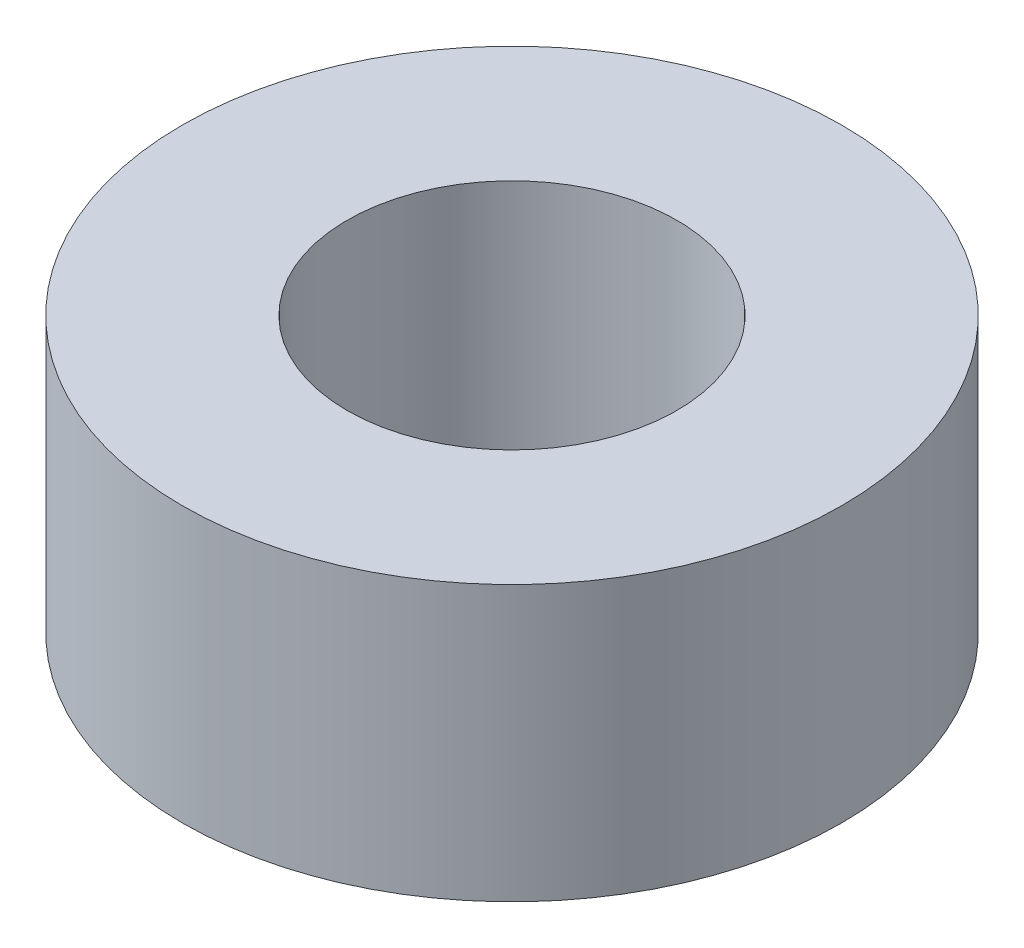
ISO-10303-21;
HEADER;
FILE_DESCRIPTION(('STEP AP214'),'2;1');
FILE_NAME('part.step','',(''),(''),'','','');
FILE_SCHEMA(('AUTOMOTIVE_DESIGN { 1 0 10303 214 1 1 1 1 }'));
ENDSEC;
DATA;
#1=APPLICATION_CONTEXT('core data for automotive mechanical design processes');
#2=APPLICATION_PROTOCOL_DEFINITION('international standard','automotive_design',2000,#1);
#3=PRODUCT_CONTEXT('',#1,'mechanical');
#4=PRODUCT('Part','Part','',(#3));
#5=PRODUCT_RELATED_PRODUCT_CATEGORY('part','',(#4));
#6=PRODUCT_DEFINITION_FORMATION('','',#4);
#7=PRODUCT_DEFINITION_CONTEXT('part definition',#1,'design');
#8=PRODUCT_DEFINITION('design','',#6,#7);
#9=PRODUCT_DEFINITION_SHAPE('','',#8);
#10=(LENGTH_UNIT() NAMED_UNIT(*) SI_UNIT(.MILLI.,.METRE.));
#11=(NAMED_UNIT(*) PLANE_ANGLE_UNIT() SI_UNIT($,.RADIAN.));
#12=(NAMED_UNIT(*) SI_UNIT($,.STERADIAN.) SOLID_ANGLE_UNIT());
#13=UNCERTAINTY_MEASURE_WITH_UNIT(LENGTH_MEASURE(1.E-05),#10,'distance_accuracy_value','');
#14=(GEOMETRIC_REPRESENTATION_CONTEXT(3) GLOBAL_UNCERTAINTY_ASSIGNED_CONTEXT((#13)) GLOBAL_UNIT_ASSIGNED_CONTEXT((#10,
#11,#12)) REPRESENTATION_CONTEXT('',''));
#15=CARTESIAN_POINT('',(0.,0.,0.));
#16=DIRECTION('',(0.,0.,1.));
#17=DIRECTION('',(1.,0.,0.));
#18=AXIS2_PLACEMENT_3D('',#15,#16,#17);
#19=CARTESIAN_POINT('',(0.,2.5,0.));
#20=DIRECTION('',(0.,1.,0.));
#21=DIRECTION('',(0.,0.,1.));
#22=AXIS2_PLACEMENT_3D('',#19,#20,#21);
#23=PLANE('',#22);
#24=CARTESIAN_POINT('',(0.,2.5,0.));
#25=DIRECTION('',(0.,1.,0.));
#26=DIRECTION('',(0.,0.,1.));
#27=AXIS2_PLACEMENT_3D('',#24,#25,#26);
#28=CIRCLE('',#27,3.);
#29=CARTESIAN_POINT('',(0.,2.5,3.));
#30=VERTEX_POINT('',#29);
#31=EDGE_CURVE('E10',#30,#30,#28,.T.);
#32=ORIENTED_EDGE('',*,*,#31,.T.);
#33=EDGE_LOOP('',(#32));
#34=FACE_BOUND('',#33,.T.);
#35=CARTESIAN_POINT('',(0.,2.5,0.));
#36=DIRECTION('',(0.,1.,0.));
#37=DIRECTION('',(0.,0.,1.));
#38=AXIS2_PLACEMENT_3D('',#35,#36,#37);
#39=CIRCLE('',#38,1.5);
#40=CARTESIAN_POINT('',(0.,2.5,1.5));
#41=VERTEX_POINT('',#40);
#42=EDGE_CURVE('E50',#41,#41,#39,.T.);
#43=ORIENTED_EDGE('',*,*,#42,.F.);
#44=EDGE_LOOP('',(#43));
#45=FACE_BOUND('',#44,.T.);
#46=ADVANCED_FACE('F37',(#34,#45),#23,.T.);
#47=CARTESIAN_POINT('',(0.,0.,0.));
#48=DIRECTION('',(0.,1.,0.));
#49=DIRECTION('',(0.,0.,1.));
#50=AXIS2_PLACEMENT_3D('',#47,#48,#49);
#51=PLANE('',#50);
#52=CARTESIAN_POINT('',(0.,0.,0.));
#53=DIRECTION('',(0.,1.,0.));
#54=DIRECTION('',(0.,0.,1.));
#55=AXIS2_PLACEMENT_3D('',#52,#53,#54);
#56=CIRCLE('',#55,3.);
#57=CARTESIAN_POINT('',(0.,0.,3.));
#58=VERTEX_POINT('',#57);
#59=EDGE_CURVE('E41',#58,#58,#56,.T.);
#60=ORIENTED_EDGE('',*,*,#59,.F.);
#61=EDGE_LOOP('',(#60));
#62=FACE_BOUND('',#61,.T.);
#63=CARTESIAN_POINT('',(0.,0.,0.));
#64=DIRECTION('',(0.,1.,0.));
#65=DIRECTION('',(0.,0.,1.));
#66=AXIS2_PLACEMENT_3D('',#63,#64,#65);
#67=CIRCLE('',#66,1.5);
#68=CARTESIAN_POINT('',(0.,0.,1.5));
#69=VERTEX_POINT('',#68);
#70=EDGE_CURVE('E52',#69,#69,#67,.T.);
#71=ORIENTED_EDGE('',*,*,#70,.T.);
#72=EDGE_LOOP('',(#71));
#73=FACE_BOUND('',#72,.T.);
#74=ADVANCED_FACE('F64',(#62,#73),#51,.F.);
#75=CARTESIAN_POINT('',(0.,2.5,0.));
#76=DIRECTION('',(0.,-1.,0.));
#77=DIRECTION('',(0.,0.,-1.));
#78=AXIS2_PLACEMENT_3D('',#75,#76,#77);
#79=CYLINDRICAL_SURFACE('',#78,3.);
#80=ORIENTED_EDGE('',*,*,#31,.F.);
#81=EDGE_LOOP('',(#80));
#82=FACE_BOUND('',#81,.T.);
#83=ORIENTED_EDGE('',*,*,#59,.T.);
#84=EDGE_LOOP('',(#83));
#85=FACE_BOUND('',#84,.T.);
#86=ADVANCED_FACE('F39',(#82,#85),#79,.T.);
#87=CARTESIAN_POINT('',(0.,2.5,0.));
#88=DIRECTION('',(0.,-1.,0.));
#89=DIRECTION('',(0.,0.,-1.));
#90=AXIS2_PLACEMENT_3D('',#87,#88,#89);
#91=CYLINDRICAL_SURFACE('',#90,1.5);
#92=ORIENTED_EDGE('',*,*,#42,.T.);
#93=EDGE_LOOP('',(#92));
#94=FACE_BOUND('',#93,.T.);
#95=ORIENTED_EDGE('',*,*,#70,.F.);
#96=EDGE_LOOP('',(#95));
#97=FACE_BOUND('',#96,.T.);
#98=ADVANCED_FACE('F60',(#94,#97),#91,.F.);
#99=CLOSED_SHELL('',(#46,#74,#86,#98));
#100=MANIFOLD_SOLID_BREP('B2',#99);
#101=ADVANCED_BREP_SHAPE_REPRESENTATION('',(#18,#100),#14);
#102=SHAPE_DEFINITION_REPRESENTATION(#9,#101);
ENDSEC;
END-ISO-10303-21;
